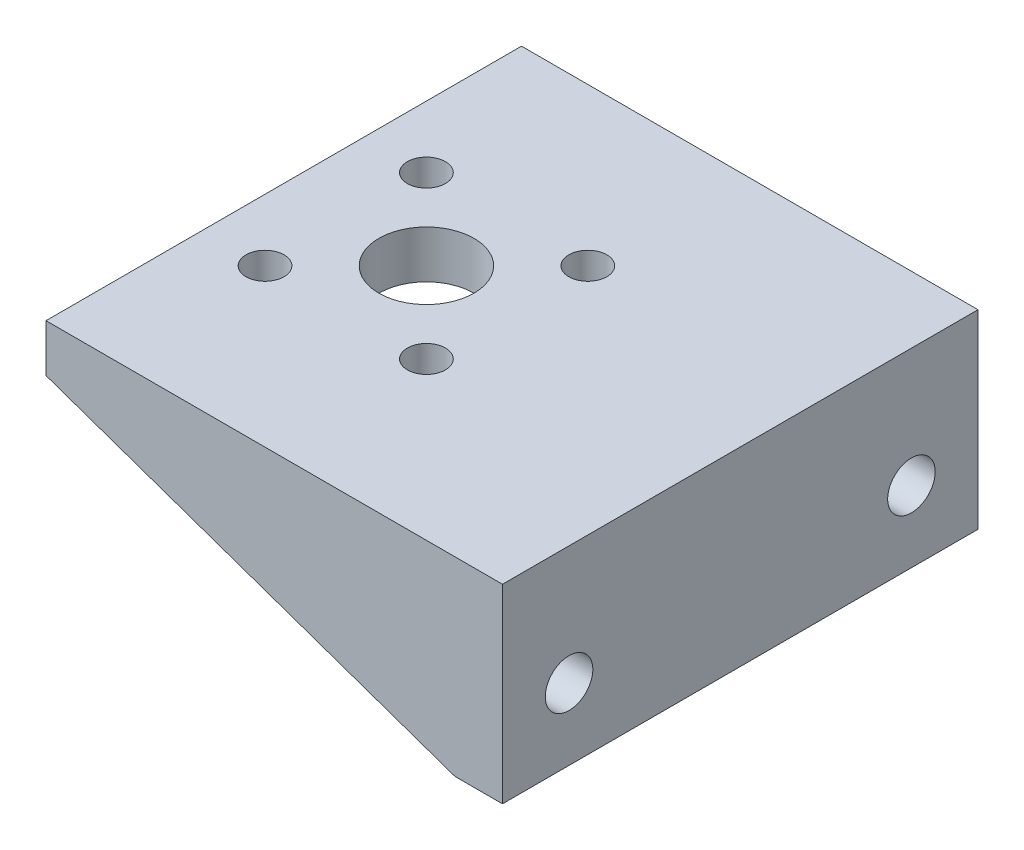
ISO-10303-21;
HEADER;
FILE_DESCRIPTION(('STEP AP214'),'2;1');
FILE_NAME('part.step','',(''),(''),'','','');
FILE_SCHEMA(('AUTOMOTIVE_DESIGN { 1 0 10303 214 1 1 1 1 }'));
ENDSEC;
DATA;
#1=APPLICATION_CONTEXT('core data for automotive mechanical design processes');
#2=APPLICATION_PROTOCOL_DEFINITION('international standard','automotive_design',2000,#1);
#3=PRODUCT_CONTEXT('',#1,'mechanical');
#4=PRODUCT('Part','Part','',(#3));
#5=PRODUCT_RELATED_PRODUCT_CATEGORY('part','',(#4));
#6=PRODUCT_DEFINITION_FORMATION('','',#4);
#7=PRODUCT_DEFINITION_CONTEXT('part definition',#1,'design');
#8=PRODUCT_DEFINITION('design','',#6,#7);
#9=PRODUCT_DEFINITION_SHAPE('','',#8);
#10=(LENGTH_UNIT() NAMED_UNIT(*) SI_UNIT(.MILLI.,.METRE.));
#11=(NAMED_UNIT(*) PLANE_ANGLE_UNIT() SI_UNIT($,.RADIAN.));
#12=(NAMED_UNIT(*) SI_UNIT($,.STERADIAN.) SOLID_ANGLE_UNIT());
#13=UNCERTAINTY_MEASURE_WITH_UNIT(LENGTH_MEASURE(1.E-05),#10,'distance_accuracy_value','');
#14=(GEOMETRIC_REPRESENTATION_CONTEXT(3) GLOBAL_UNCERTAINTY_ASSIGNED_CONTEXT((#13)) GLOBAL_UNIT_ASSIGNED_CONTEXT((#10,
#11,#12)) REPRESENTATION_CONTEXT('',''));
#15=CARTESIAN_POINT('',(0.,0.,0.));
#16=DIRECTION('',(0.,0.,1.));
#17=DIRECTION('',(1.,0.,0.));
#18=AXIS2_PLACEMENT_3D('',#15,#16,#17);
#19=CARTESIAN_POINT('',(0.,0.,0.));
#20=DIRECTION('',(0.,1.,0.));
#21=DIRECTION('',(0.,0.,1.));
#22=AXIS2_PLACEMENT_3D('',#19,#20,#21);
#23=PLANE('',#22);
#24=CARTESIAN_POINT('',(8.48528137423915,0.,-8.48528137423851));
#25=DIRECTION('',(0.,1.,0.));
#26=DIRECTION('',(0.,0.,1.));
#27=AXIS2_PLACEMENT_3D('',#24,#25,#26);
#28=CIRCLE('',#27,2.);
#29=CARTESIAN_POINT('',(8.48528137423915,0.,-6.48528137423851));
#30=VERTEX_POINT('',#29);
#31=EDGE_CURVE('E172',#30,#30,#28,.T.);
#32=ORIENTED_EDGE('',*,*,#31,.T.);
#33=EDGE_LOOP('',(#32));
#34=FACE_BOUND('',#33,.T.);
#35=CARTESIAN_POINT('',(-8.48528137423783,0.,8.48528137423994));
#36=DIRECTION('',(0.,1.,0.));
#37=DIRECTION('',(0.,0.,1.));
#38=AXIS2_PLACEMENT_3D('',#35,#36,#37);
#39=CIRCLE('',#38,2.);
#40=CARTESIAN_POINT('',(-8.48528137423783,0.,10.4852813742399));
#41=VERTEX_POINT('',#40);
#42=EDGE_CURVE('E191',#41,#41,#39,.T.);
#43=ORIENTED_EDGE('',*,*,#42,.T.);
#44=EDGE_LOOP('',(#43));
#45=FACE_BOUND('',#44,.T.);
#46=CARTESIAN_POINT('',(8.48528137423923,0.,8.48528137423865));
#47=DIRECTION('',(0.,1.,0.));
#48=DIRECTION('',(0.,0.,1.));
#49=AXIS2_PLACEMENT_3D('',#46,#47,#48);
#50=CIRCLE('',#49,2.);
#51=CARTESIAN_POINT('',(8.48528137423923,0.,10.4852813742387));
#52=VERTEX_POINT('',#51);
#53=EDGE_CURVE('E188',#52,#52,#50,.T.);
#54=ORIENTED_EDGE('',*,*,#53,.T.);
#55=EDGE_LOOP('',(#54));
#56=FACE_BOUND('',#55,.T.);
#57=CARTESIAN_POINT('',(-8.48528137423796,0.,-8.48528137423843));
#58=DIRECTION('',(0.,1.,0.));
#59=DIRECTION('',(0.,0.,1.));
#60=AXIS2_PLACEMENT_3D('',#57,#58,#59);
#61=CIRCLE('',#60,2.);
#62=CARTESIAN_POINT('',(-8.48528137423796,0.,-6.48528137423843));
#63=VERTEX_POINT('',#62);
#64=EDGE_CURVE('E164',#63,#63,#61,.T.);
#65=ORIENTED_EDGE('',*,*,#64,.T.);
#66=EDGE_LOOP('',(#65));
#67=FACE_BOUND('',#66,.T.);
#68=CARTESIAN_POINT('',(0.,0.,0.));
#69=DIRECTION('',(0.,1.,0.));
#70=DIRECTION('',(0.,0.,1.));
#71=AXIS2_PLACEMENT_3D('',#68,#69,#70);
#72=CIRCLE('',#71,5.);
#73=CARTESIAN_POINT('',(0.,0.,5.));
#74=VERTEX_POINT('',#73);
#75=EDGE_CURVE('E165',#74,#74,#72,.T.);
#76=ORIENTED_EDGE('',*,*,#75,.T.);
#77=EDGE_LOOP('',(#76));
#78=FACE_BOUND('',#77,.T.);
#79=DIRECTION('',(-1.,0.,0.));
#80=VECTOR('',#79,1.);
#81=CARTESIAN_POINT('',(-15.,0.,-22.));
#82=LINE('',#81,#80);
#83=CARTESIAN_POINT('',(28.,0.,-22.));
#84=VERTEX_POINT('',#83);
#85=CARTESIAN_POINT('',(-15.,0.,-22.));
#86=VERTEX_POINT('',#85);
#87=EDGE_CURVE('E103',#84,#86,#82,.T.);
#88=ORIENTED_EDGE('',*,*,#87,.F.);
#89=DIRECTION('',(0.,0.,1.));
#90=VECTOR('',#89,1.);
#91=CARTESIAN_POINT('',(28.,0.,0.));
#92=LINE('',#91,#90);
#93=CARTESIAN_POINT('',(28.,0.,22.));
#94=VERTEX_POINT('',#93);
#95=EDGE_CURVE('E11',#84,#94,#92,.T.);
#96=ORIENTED_EDGE('',*,*,#95,.T.);
#97=DIRECTION('',(-1.,0.,0.));
#98=VECTOR('',#97,1.);
#99=CARTESIAN_POINT('',(-15.,0.,22.));
#100=LINE('',#99,#98);
#101=CARTESIAN_POINT('',(-15.,0.,22.));
#102=VERTEX_POINT('',#101);
#103=EDGE_CURVE('E244',#94,#102,#100,.T.);
#104=ORIENTED_EDGE('',*,*,#103,.T.);
#105=DIRECTION('',(0.,0.,1.));
#106=VECTOR('',#105,1.);
#107=CARTESIAN_POINT('',(-15.,0.,25.));
#108=LINE('',#107,#106);
#109=EDGE_CURVE('E168',#86,#102,#108,.T.);
#110=ORIENTED_EDGE('',*,*,#109,.F.);
#111=EDGE_LOOP('',(#88,#96,#104,#110));
#112=FACE_BOUND('',#111,.T.);
#113=ADVANCED_FACE('F32',(#34,#45,#56,#67,#78,#112),#23,.F.);
#114=CARTESIAN_POINT('',(28.,0.,0.));
#115=DIRECTION('',(-1.,0.,0.));
#116=DIRECTION('',(0.,0.,1.));
#117=AXIS2_PLACEMENT_3D('',#114,#115,#116);
#118=PLANE('',#117);
#119=CARTESIAN_POINT('',(28.,-7.5,-18.));
#120=DIRECTION('',(1.,0.,0.));
#121=DIRECTION('',(0.,0.,-1.));
#122=AXIS2_PLACEMENT_3D('',#119,#120,#121);
#123=CIRCLE('',#122,2.5);
#124=CARTESIAN_POINT('',(28.,-7.5,-20.5));
#125=VERTEX_POINT('',#124);
#126=EDGE_CURVE('E134',#125,#125,#123,.T.);
#127=ORIENTED_EDGE('',*,*,#126,.T.);
#128=EDGE_LOOP('',(#127));
#129=FACE_BOUND('',#128,.T.);
#130=CARTESIAN_POINT('',(28.,-7.5,18.));
#131=DIRECTION('',(1.,0.,0.));
#132=DIRECTION('',(0.,0.,1.));
#133=AXIS2_PLACEMENT_3D('',#130,#131,#132);
#134=CIRCLE('',#133,2.5);
#135=CARTESIAN_POINT('',(28.,-7.5,20.5));
#136=VERTEX_POINT('',#135);
#137=EDGE_CURVE('E243',#136,#136,#134,.T.);
#138=ORIENTED_EDGE('',*,*,#137,.T.);
#139=EDGE_LOOP('',(#138));
#140=FACE_BOUND('',#139,.T.);
#141=ORIENTED_EDGE('',*,*,#95,.F.);
#142=DIRECTION('',(0.,1.,0.));
#143=VECTOR('',#142,1.);
#144=CARTESIAN_POINT('',(28.,0.,-22.));
#145=LINE('',#144,#143);
#146=CARTESIAN_POINT('',(28.,-15.,-22.));
#147=VERTEX_POINT('',#146);
#148=EDGE_CURVE('E101',#147,#84,#145,.T.);
#149=ORIENTED_EDGE('',*,*,#148,.F.);
#150=DIRECTION('',(0.,0.,-1.));
#151=VECTOR('',#150,1.);
#152=CARTESIAN_POINT('',(28.,-15.,-25.));
#153=LINE('',#152,#151);
#154=CARTESIAN_POINT('',(28.,-15.,22.));
#155=VERTEX_POINT('',#154);
#156=EDGE_CURVE('E123',#155,#147,#153,.T.);
#157=ORIENTED_EDGE('',*,*,#156,.F.);
#158=DIRECTION('',(0.,1.,0.));
#159=VECTOR('',#158,1.);
#160=CARTESIAN_POINT('',(28.,0.,22.));
#161=LINE('',#160,#159);
#162=EDGE_CURVE('E293',#155,#94,#161,.T.);
#163=ORIENTED_EDGE('',*,*,#162,.T.);
#164=EDGE_LOOP('',(#141,#149,#157,#163));
#165=FACE_BOUND('',#164,.T.);
#166=ADVANCED_FACE('F121',(#129,#140,#165),#118,.T.);
#167=CARTESIAN_POINT('',(-15.,5.,25.));
#168=DIRECTION('',(1.,0.,0.));
#169=DIRECTION('',(0.,0.,-1.));
#170=AXIS2_PLACEMENT_3D('',#167,#168,#169);
#171=PLANE('',#170);
#172=CARTESIAN_POINT('',(-15.,0.,-25.));
#173=VERTEX_POINT('',#172);
#174=EDGE_CURVE('E176',#173,#86,#108,.T.);
#175=ORIENTED_EDGE('',*,*,#174,.T.);
#176=ORIENTED_EDGE('',*,*,#109,.T.);
#177=DIRECTION('',(0.,0.,1.));
#178=VECTOR('',#177,1.);
#179=CARTESIAN_POINT('',(-15.,0.,22.));
#180=LINE('',#179,#178);
#181=CARTESIAN_POINT('',(-15.,0.,25.));
#182=VERTEX_POINT('',#181);
#183=EDGE_CURVE('E240',#102,#182,#180,.T.);
#184=ORIENTED_EDGE('',*,*,#183,.T.);
#185=DIRECTION('',(0.,-1.,0.));
#186=VECTOR('',#185,1.);
#187=CARTESIAN_POINT('',(-15.,5.,25.));
#188=LINE('',#187,#186);
#189=CARTESIAN_POINT('',(-15.,5.,25.));
#190=VERTEX_POINT('',#189);
#191=EDGE_CURVE('E40',#190,#182,#188,.T.);
#192=ORIENTED_EDGE('',*,*,#191,.F.);
#193=DIRECTION('',(0.,0.,1.));
#194=VECTOR('',#193,1.);
#195=CARTESIAN_POINT('',(-15.,5.,25.));
#196=LINE('',#195,#194);
#197=CARTESIAN_POINT('',(-15.,5.,-25.));
#198=VERTEX_POINT('',#197);
#199=EDGE_CURVE('E173',#198,#190,#196,.T.);
#200=ORIENTED_EDGE('',*,*,#199,.F.);
#201=DIRECTION('',(0.,-1.,0.));
#202=VECTOR('',#201,1.);
#203=CARTESIAN_POINT('',(-15.,5.,-25.));
#204=LINE('',#203,#202);
#205=EDGE_CURVE('E179',#198,#173,#204,.T.);
#206=ORIENTED_EDGE('',*,*,#205,.T.);
#207=EDGE_LOOP('',(#175,#176,#184,#192,#200,#206));
#208=FACE_BOUND('',#207,.T.);
#209=ADVANCED_FACE('F34',(#208),#171,.F.);
#210=CARTESIAN_POINT('',(15.,5.,25.));
#211=DIRECTION('',(0.,0.,-1.));
#212=DIRECTION('',(-1.,0.,0.));
#213=AXIS2_PLACEMENT_3D('',#210,#211,#212);
#214=PLANE('',#213);
#215=ORIENTED_EDGE('',*,*,#191,.T.);
#216=DIRECTION('',(0.944200181445776,-0.329372156318294,0.));
#217=VECTOR('',#216,1.);
#218=CARTESIAN_POINT('',(28.,-15.,25.));
#219=LINE('',#218,#217);
#220=CARTESIAN_POINT('',(28.,-15.,25.));
#221=VERTEX_POINT('',#220);
#222=EDGE_CURVE('E116',#182,#221,#219,.T.);
#223=ORIENTED_EDGE('',*,*,#222,.T.);
#224=DIRECTION('',(1.,0.,0.));
#225=VECTOR('',#224,1.);
#226=CARTESIAN_POINT('',(28.,-15.,25.));
#227=LINE('',#226,#225);
#228=CARTESIAN_POINT('',(33.,-15.,25.));
#229=VERTEX_POINT('',#228);
#230=EDGE_CURVE('E132',#221,#229,#227,.T.);
#231=ORIENTED_EDGE('',*,*,#230,.T.);
#232=DIRECTION('',(0.,-1.,0.));
#233=VECTOR('',#232,1.);
#234=CARTESIAN_POINT('',(33.,5.,25.));
#235=LINE('',#234,#233);
#236=CARTESIAN_POINT('',(33.,5.,25.));
#237=VERTEX_POINT('',#236);
#238=EDGE_CURVE('E142',#237,#229,#235,.T.);
#239=ORIENTED_EDGE('',*,*,#238,.F.);
#240=DIRECTION('',(1.,0.,0.));
#241=VECTOR('',#240,1.);
#242=CARTESIAN_POINT('',(15.,5.,25.));
#243=LINE('',#242,#241);
#244=EDGE_CURVE('E175',#190,#237,#243,.T.);
#245=ORIENTED_EDGE('',*,*,#244,.F.);
#246=EDGE_LOOP('',(#215,#223,#231,#239,#245));
#247=FACE_BOUND('',#246,.T.);
#248=ADVANCED_FACE('F227',(#247),#214,.F.);
#249=CARTESIAN_POINT('',(15.,5.,-25.));
#250=DIRECTION('',(0.,0.,1.));
#251=DIRECTION('',(1.,0.,0.));
#252=AXIS2_PLACEMENT_3D('',#249,#250,#251);
#253=PLANE('',#252);
#254=ORIENTED_EDGE('',*,*,#205,.F.);
#255=DIRECTION('',(-1.,0.,0.));
#256=VECTOR('',#255,1.);
#257=CARTESIAN_POINT('',(15.,5.,-25.));
#258=LINE('',#257,#256);
#259=CARTESIAN_POINT('',(33.,5.,-25.));
#260=VERTEX_POINT('',#259);
#261=EDGE_CURVE('E55',#260,#198,#258,.T.);
#262=ORIENTED_EDGE('',*,*,#261,.F.);
#263=DIRECTION('',(0.,1.,0.));
#264=VECTOR('',#263,1.);
#265=CARTESIAN_POINT('',(33.,5.,-25.));
#266=LINE('',#265,#264);
#267=CARTESIAN_POINT('',(33.,-15.,-25.));
#268=VERTEX_POINT('',#267);
#269=EDGE_CURVE('E146',#268,#260,#266,.T.);
#270=ORIENTED_EDGE('',*,*,#269,.F.);
#271=DIRECTION('',(1.,0.,0.));
#272=VECTOR('',#271,1.);
#273=CARTESIAN_POINT('',(28.,-15.,-25.));
#274=LINE('',#273,#272);
#275=CARTESIAN_POINT('',(28.,-15.,-25.));
#276=VERTEX_POINT('',#275);
#277=EDGE_CURVE('E140',#276,#268,#274,.T.);
#278=ORIENTED_EDGE('',*,*,#277,.F.);
#279=DIRECTION('',(0.944200181445776,-0.329372156318294,0.));
#280=VECTOR('',#279,1.);
#281=CARTESIAN_POINT('',(28.,-15.,-25.));
#282=LINE('',#281,#280);
#283=EDGE_CURVE('E111',#173,#276,#282,.T.);
#284=ORIENTED_EDGE('',*,*,#283,.F.);
#285=EDGE_LOOP('',(#254,#262,#270,#278,#284));
#286=FACE_BOUND('',#285,.T.);
#287=ADVANCED_FACE('F225',(#286),#253,.F.);
#288=CARTESIAN_POINT('',(0.,5.,0.));
#289=DIRECTION('',(0.,1.,0.));
#290=DIRECTION('',(0.,0.,1.));
#291=AXIS2_PLACEMENT_3D('',#288,#289,#290);
#292=PLANE('',#291);
#293=ORIENTED_EDGE('',*,*,#244,.T.);
#294=DIRECTION('',(0.,0.,1.));
#295=VECTOR('',#294,1.);
#296=CARTESIAN_POINT('',(33.,5.,25.));
#297=LINE('',#296,#295);
#298=EDGE_CURVE('E149',#260,#237,#297,.T.);
#299=ORIENTED_EDGE('',*,*,#298,.F.);
#300=ORIENTED_EDGE('',*,*,#261,.T.);
#301=ORIENTED_EDGE('',*,*,#199,.T.);
#302=EDGE_LOOP('',(#293,#299,#300,#301));
#303=FACE_BOUND('',#302,.T.);
#304=CARTESIAN_POINT('',(8.48528137423915,5.,-8.48528137423851));
#305=DIRECTION('',(0.,1.,0.));
#306=DIRECTION('',(0.,0.,1.));
#307=AXIS2_PLACEMENT_3D('',#304,#305,#306);
#308=CIRCLE('',#307,2.);
#309=CARTESIAN_POINT('',(8.48528137423915,5.,-6.48528137423851));
#310=VERTEX_POINT('',#309);
#311=EDGE_CURVE('E156',#310,#310,#308,.T.);
#312=ORIENTED_EDGE('',*,*,#311,.F.);
#313=EDGE_LOOP('',(#312));
#314=FACE_BOUND('',#313,.T.);
#315=CARTESIAN_POINT('',(-8.48528137423783,5.,8.48528137423994));
#316=DIRECTION('',(0.,1.,0.));
#317=DIRECTION('',(0.,0.,1.));
#318=AXIS2_PLACEMENT_3D('',#315,#316,#317);
#319=CIRCLE('',#318,2.);
#320=CARTESIAN_POINT('',(-8.48528137423783,5.,10.4852813742399));
#321=VERTEX_POINT('',#320);
#322=EDGE_CURVE('E155',#321,#321,#319,.T.);
#323=ORIENTED_EDGE('',*,*,#322,.F.);
#324=EDGE_LOOP('',(#323));
#325=FACE_BOUND('',#324,.T.);
#326=CARTESIAN_POINT('',(8.48528137423923,5.,8.48528137423865));
#327=DIRECTION('',(0.,1.,0.));
#328=DIRECTION('',(0.,0.,1.));
#329=AXIS2_PLACEMENT_3D('',#326,#327,#328);
#330=CIRCLE('',#329,2.);
#331=CARTESIAN_POINT('',(8.48528137423923,5.,10.4852813742387));
#332=VERTEX_POINT('',#331);
#333=EDGE_CURVE('E152',#332,#332,#330,.T.);
#334=ORIENTED_EDGE('',*,*,#333,.F.);
#335=EDGE_LOOP('',(#334));
#336=FACE_BOUND('',#335,.T.);
#337=CARTESIAN_POINT('',(-8.48528137423796,5.,-8.48528137423843));
#338=DIRECTION('',(0.,1.,0.));
#339=DIRECTION('',(0.,0.,1.));
#340=AXIS2_PLACEMENT_3D('',#337,#338,#339);
#341=CIRCLE('',#340,2.);
#342=CARTESIAN_POINT('',(-8.48528137423796,5.,-6.48528137423843));
#343=VERTEX_POINT('',#342);
#344=EDGE_CURVE('E159',#343,#343,#341,.T.);
#345=ORIENTED_EDGE('',*,*,#344,.F.);
#346=EDGE_LOOP('',(#345));
#347=FACE_BOUND('',#346,.T.);
#348=CARTESIAN_POINT('',(0.,5.,0.));
#349=DIRECTION('',(0.,1.,0.));
#350=DIRECTION('',(0.,0.,1.));
#351=AXIS2_PLACEMENT_3D('',#348,#349,#350);
#352=CIRCLE('',#351,5.);
#353=CARTESIAN_POINT('',(0.,5.,5.));
#354=VERTEX_POINT('',#353);
#355=EDGE_CURVE('E169',#354,#354,#352,.T.);
#356=ORIENTED_EDGE('',*,*,#355,.F.);
#357=EDGE_LOOP('',(#356));
#358=FACE_BOUND('',#357,.T.);
#359=ADVANCED_FACE('F223',(#303,#314,#325,#336,#347,#358),#292,.T.);
#360=CARTESIAN_POINT('',(0.,0.,0.));
#361=DIRECTION('',(0.,1.,0.));
#362=DIRECTION('',(0.,0.,1.));
#363=AXIS2_PLACEMENT_3D('',#360,#361,#362);
#364=CYLINDRICAL_SURFACE('',#363,5.);
#365=ORIENTED_EDGE('',*,*,#75,.F.);
#366=EDGE_LOOP('',(#365));
#367=FACE_BOUND('',#366,.T.);
#368=ORIENTED_EDGE('',*,*,#355,.T.);
#369=EDGE_LOOP('',(#368));
#370=FACE_BOUND('',#369,.T.);
#371=ADVANCED_FACE('F266',(#367,#370),#364,.F.);
#372=CARTESIAN_POINT('',(-8.48528137423796,-5.,-8.48528137423843));
#373=DIRECTION('',(0.,1.,0.));
#374=DIRECTION('',(0.,0.,1.));
#375=AXIS2_PLACEMENT_3D('',#372,#373,#374);
#376=CYLINDRICAL_SURFACE('',#375,2.);
#377=ORIENTED_EDGE('',*,*,#344,.T.);
#378=EDGE_LOOP('',(#377));
#379=FACE_BOUND('',#378,.T.);
#380=ORIENTED_EDGE('',*,*,#64,.F.);
#381=EDGE_LOOP('',(#380));
#382=FACE_BOUND('',#381,.T.);
#383=ADVANCED_FACE('F278',(#379,#382),#376,.F.);
#384=CARTESIAN_POINT('',(8.48528137423923,-5.,8.48528137423865));
#385=DIRECTION('',(0.,1.,0.));
#386=DIRECTION('',(0.,0.,1.));
#387=AXIS2_PLACEMENT_3D('',#384,#385,#386);
#388=CYLINDRICAL_SURFACE('',#387,2.);
#389=ORIENTED_EDGE('',*,*,#333,.T.);
#390=EDGE_LOOP('',(#389));
#391=FACE_BOUND('',#390,.T.);
#392=ORIENTED_EDGE('',*,*,#53,.F.);
#393=EDGE_LOOP('',(#392));
#394=FACE_BOUND('',#393,.T.);
#395=ADVANCED_FACE('F210',(#391,#394),#388,.F.);
#396=CARTESIAN_POINT('',(-8.48528137423783,-5.,8.48528137423994));
#397=DIRECTION('',(0.,1.,0.));
#398=DIRECTION('',(0.,0.,1.));
#399=AXIS2_PLACEMENT_3D('',#396,#397,#398);
#400=CYLINDRICAL_SURFACE('',#399,2.);
#401=ORIENTED_EDGE('',*,*,#322,.T.);
#402=EDGE_LOOP('',(#401));
#403=FACE_BOUND('',#402,.T.);
#404=ORIENTED_EDGE('',*,*,#42,.F.);
#405=EDGE_LOOP('',(#404));
#406=FACE_BOUND('',#405,.T.);
#407=ADVANCED_FACE('F201',(#403,#406),#400,.F.);
#408=CARTESIAN_POINT('',(8.48528137423915,-5.,-8.48528137423851));
#409=DIRECTION('',(0.,1.,0.));
#410=DIRECTION('',(0.,0.,1.));
#411=AXIS2_PLACEMENT_3D('',#408,#409,#410);
#412=CYLINDRICAL_SURFACE('',#411,2.);
#413=ORIENTED_EDGE('',*,*,#311,.T.);
#414=EDGE_LOOP('',(#413));
#415=FACE_BOUND('',#414,.T.);
#416=ORIENTED_EDGE('',*,*,#31,.F.);
#417=EDGE_LOOP('',(#416));
#418=FACE_BOUND('',#417,.T.);
#419=ADVANCED_FACE('F198',(#415,#418),#412,.F.);
#420=CARTESIAN_POINT('',(33.,0.,0.));
#421=DIRECTION('',(1.,0.,0.));
#422=DIRECTION('',(0.,0.,-1.));
#423=AXIS2_PLACEMENT_3D('',#420,#421,#422);
#424=PLANE('',#423);
#425=CARTESIAN_POINT('',(33.,-7.5,-18.));
#426=DIRECTION('',(1.,0.,0.));
#427=DIRECTION('',(0.,0.,-1.));
#428=AXIS2_PLACEMENT_3D('',#425,#426,#427);
#429=CIRCLE('',#428,2.5);
#430=CARTESIAN_POINT('',(33.,-7.5,-20.5));
#431=VERTEX_POINT('',#430);
#432=EDGE_CURVE('E250',#431,#431,#429,.T.);
#433=ORIENTED_EDGE('',*,*,#432,.F.);
#434=EDGE_LOOP('',(#433));
#435=FACE_BOUND('',#434,.T.);
#436=CARTESIAN_POINT('',(33.,-7.5,18.));
#437=DIRECTION('',(1.,0.,0.));
#438=DIRECTION('',(0.,0.,1.));
#439=AXIS2_PLACEMENT_3D('',#436,#437,#438);
#440=CIRCLE('',#439,2.5);
#441=CARTESIAN_POINT('',(33.,-7.5,20.5));
#442=VERTEX_POINT('',#441);
#443=EDGE_CURVE('E137',#442,#442,#440,.T.);
#444=ORIENTED_EDGE('',*,*,#443,.F.);
#445=EDGE_LOOP('',(#444));
#446=FACE_BOUND('',#445,.T.);
#447=ORIENTED_EDGE('',*,*,#238,.T.);
#448=DIRECTION('',(0.,0.,-1.));
#449=VECTOR('',#448,1.);
#450=CARTESIAN_POINT('',(33.,-15.,-25.));
#451=LINE('',#450,#449);
#452=EDGE_CURVE('E130',#229,#268,#451,.T.);
#453=ORIENTED_EDGE('',*,*,#452,.T.);
#454=ORIENTED_EDGE('',*,*,#269,.T.);
#455=ORIENTED_EDGE('',*,*,#298,.T.);
#456=EDGE_LOOP('',(#447,#453,#454,#455));
#457=FACE_BOUND('',#456,.T.);
#458=ADVANCED_FACE('F200',(#435,#446,#457),#424,.T.);
#459=CARTESIAN_POINT('',(28.,-15.,-25.));
#460=DIRECTION('',(0.,-1.,0.));
#461=DIRECTION('',(0.,0.,-1.));
#462=AXIS2_PLACEMENT_3D('',#459,#460,#461);
#463=PLANE('',#462);
#464=ORIENTED_EDGE('',*,*,#452,.F.);
#465=ORIENTED_EDGE('',*,*,#230,.F.);
#466=EDGE_CURVE('E129',#221,#155,#153,.T.);
#467=ORIENTED_EDGE('',*,*,#466,.T.);
#468=ORIENTED_EDGE('',*,*,#156,.T.);
#469=DIRECTION('',(0.,0.,-1.));
#470=VECTOR('',#469,1.);
#471=CARTESIAN_POINT('',(28.,-15.,-22.));
#472=LINE('',#471,#470);
#473=EDGE_CURVE('E108',#147,#276,#472,.T.);
#474=ORIENTED_EDGE('',*,*,#473,.T.);
#475=ORIENTED_EDGE('',*,*,#277,.T.);
#476=EDGE_LOOP('',(#464,#465,#467,#468,#474,#475));
#477=FACE_BOUND('',#476,.T.);
#478=ADVANCED_FACE('F127',(#477),#463,.T.);
#479=CARTESIAN_POINT('',(28.,-7.5,18.));
#480=DIRECTION('',(1.,0.,0.));
#481=DIRECTION('',(0.,0.,-1.));
#482=AXIS2_PLACEMENT_3D('',#479,#480,#481);
#483=CYLINDRICAL_SURFACE('',#482,2.5);
#484=ORIENTED_EDGE('',*,*,#137,.F.);
#485=EDGE_LOOP('',(#484));
#486=FACE_BOUND('',#485,.T.);
#487=ORIENTED_EDGE('',*,*,#443,.T.);
#488=EDGE_LOOP('',(#487));
#489=FACE_BOUND('',#488,.T.);
#490=ADVANCED_FACE('F256',(#486,#489),#483,.F.);
#491=CARTESIAN_POINT('',(28.,-7.5,-18.));
#492=DIRECTION('',(1.,0.,0.));
#493=DIRECTION('',(0.,0.,-1.));
#494=AXIS2_PLACEMENT_3D('',#491,#492,#493);
#495=CYLINDRICAL_SURFACE('',#494,2.5);
#496=ORIENTED_EDGE('',*,*,#126,.F.);
#497=EDGE_LOOP('',(#496));
#498=FACE_BOUND('',#497,.T.);
#499=ORIENTED_EDGE('',*,*,#432,.T.);
#500=EDGE_LOOP('',(#499));
#501=FACE_BOUND('',#500,.T.);
#502=ADVANCED_FACE('F259',(#498,#501),#495,.F.);
#503=CARTESIAN_POINT('',(28.,-15.,22.));
#504=DIRECTION('',(-0.329372156318294,-0.944200181445776,0.));
#505=DIRECTION('',(0.944200181445776,-0.329372156318294,0.));
#506=AXIS2_PLACEMENT_3D('',#503,#504,#505);
#507=PLANE('',#506);
#508=ORIENTED_EDGE('',*,*,#222,.F.);
#509=ORIENTED_EDGE('',*,*,#183,.F.);
#510=DIRECTION('',(0.944200181445776,-0.329372156318294,0.));
#511=VECTOR('',#510,1.);
#512=CARTESIAN_POINT('',(28.,-15.,22.));
#513=LINE('',#512,#511);
#514=EDGE_CURVE('E47',#102,#155,#513,.T.);
#515=ORIENTED_EDGE('',*,*,#514,.T.);
#516=ORIENTED_EDGE('',*,*,#466,.F.);
#517=EDGE_LOOP('',(#508,#509,#515,#516));
#518=FACE_BOUND('',#517,.T.);
#519=ADVANCED_FACE('F298',(#518),#507,.T.);
#520=CARTESIAN_POINT('',(0.,0.,22.));
#521=DIRECTION('',(0.,0.,1.));
#522=DIRECTION('',(1.,0.,0.));
#523=AXIS2_PLACEMENT_3D('',#520,#521,#522);
#524=PLANE('',#523);
#525=ORIENTED_EDGE('',*,*,#162,.F.);
#526=ORIENTED_EDGE('',*,*,#514,.F.);
#527=ORIENTED_EDGE('',*,*,#103,.F.);
#528=EDGE_LOOP('',(#525,#526,#527));
#529=FACE_BOUND('',#528,.T.);
#530=ADVANCED_FACE('F296',(#529),#524,.F.);
#531=CARTESIAN_POINT('',(28.,-15.,-22.));
#532=DIRECTION('',(0.329372156318294,0.944200181445776,0.));
#533=DIRECTION('',(-0.944200181445776,0.329372156318294,0.));
#534=AXIS2_PLACEMENT_3D('',#531,#532,#533);
#535=PLANE('',#534);
#536=ORIENTED_EDGE('',*,*,#283,.T.);
#537=ORIENTED_EDGE('',*,*,#473,.F.);
#538=DIRECTION('',(0.944200181445776,-0.329372156318294,0.));
#539=VECTOR('',#538,1.);
#540=CARTESIAN_POINT('',(28.,-15.,-22.));
#541=LINE('',#540,#539);
#542=EDGE_CURVE('E97',#86,#147,#541,.T.);
#543=ORIENTED_EDGE('',*,*,#542,.F.);
#544=ORIENTED_EDGE('',*,*,#174,.F.);
#545=EDGE_LOOP('',(#536,#537,#543,#544));
#546=FACE_BOUND('',#545,.T.);
#547=ADVANCED_FACE('F109',(#546),#535,.F.);
#548=CARTESIAN_POINT('',(0.,0.,-22.));
#549=DIRECTION('',(0.,0.,-1.));
#550=DIRECTION('',(1.,0.,0.));
#551=AXIS2_PLACEMENT_3D('',#548,#549,#550);
#552=PLANE('',#551);
#553=ORIENTED_EDGE('',*,*,#148,.T.);
#554=ORIENTED_EDGE('',*,*,#87,.T.);
#555=ORIENTED_EDGE('',*,*,#542,.T.);
#556=EDGE_LOOP('',(#553,#554,#555));
#557=FACE_BOUND('',#556,.T.);
#558=ADVANCED_FACE('F99',(#557),#552,.F.);
#559=CLOSED_SHELL('',(#113,#166,#209,#248,#287,#359,#371,#383,#395,#407,#419,#458,#478,#490,
#502,#519,#530,#547,#558));
#560=MANIFOLD_SOLID_BREP('B2',#559);
#561=ADVANCED_BREP_SHAPE_REPRESENTATION('',(#18,#560),#14);
#562=SHAPE_DEFINITION_REPRESENTATION(#9,#561);
ENDSEC;
END-ISO-10303-21;
